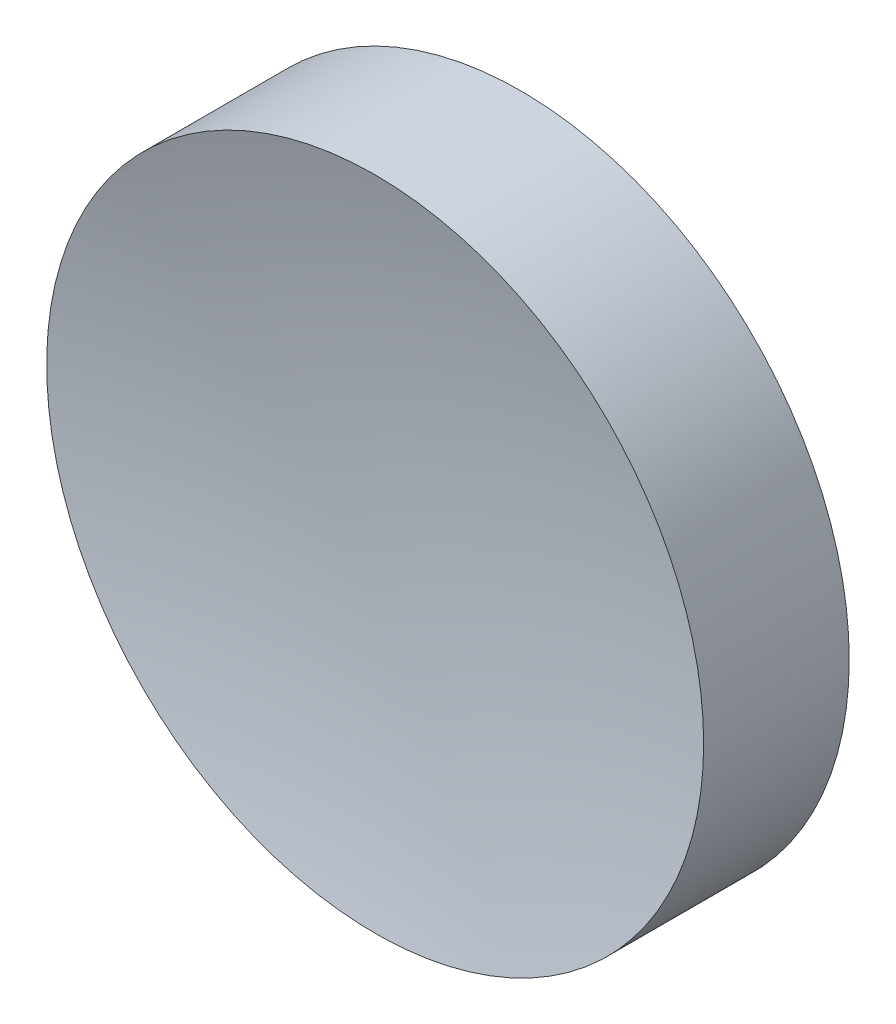
ISO-10303-21;
HEADER;
FILE_DESCRIPTION(('STEP AP214'),'2;1');
FILE_NAME('part.step','',(''),(''),'','','');
FILE_SCHEMA(('AUTOMOTIVE_DESIGN { 1 0 10303 214 1 1 1 1 }'));
ENDSEC;
DATA;
#1=APPLICATION_CONTEXT('core data for automotive mechanical design processes');
#2=APPLICATION_PROTOCOL_DEFINITION('international standard','automotive_design',2000,#1);
#3=PRODUCT_CONTEXT('',#1,'mechanical');
#4=PRODUCT('Part','Part','',(#3));
#5=PRODUCT_RELATED_PRODUCT_CATEGORY('part','',(#4));
#6=PRODUCT_DEFINITION_FORMATION('','',#4);
#7=PRODUCT_DEFINITION_CONTEXT('part definition',#1,'design');
#8=PRODUCT_DEFINITION('design','',#6,#7);
#9=PRODUCT_DEFINITION_SHAPE('','',#8);
#10=(LENGTH_UNIT() NAMED_UNIT(*) SI_UNIT(.MILLI.,.METRE.));
#11=(NAMED_UNIT(*) PLANE_ANGLE_UNIT() SI_UNIT($,.RADIAN.));
#12=(NAMED_UNIT(*) SI_UNIT($,.STERADIAN.) SOLID_ANGLE_UNIT());
#13=UNCERTAINTY_MEASURE_WITH_UNIT(LENGTH_MEASURE(1.E-05),#10,'distance_accuracy_value','');
#14=(GEOMETRIC_REPRESENTATION_CONTEXT(3) GLOBAL_UNCERTAINTY_ASSIGNED_CONTEXT((#13)) GLOBAL_UNIT_ASSIGNED_CONTEXT((#10,
#11,#12)) REPRESENTATION_CONTEXT('',''));
#15=CARTESIAN_POINT('',(0.,0.,0.));
#16=DIRECTION('',(0.,0.,1.));
#17=DIRECTION('',(1.,0.,0.));
#18=AXIS2_PLACEMENT_3D('',#15,#16,#17);
#19=CARTESIAN_POINT('',(0.,0.,52.7299919935936));
#20=DIRECTION('',(0.,0.,1.));
#21=DIRECTION('',(0.,1.,0.));
#22=AXIS2_PLACEMENT_3D('',#19,#20,#21);
#23=SPHERICAL_SURFACE('',#22,51.5);
#24=CARTESIAN_POINT('',(0.,0.,2.77000800640641));
#25=DIRECTION('',(0.,0.,1.));
#26=DIRECTION('',(1.,0.,0.));
#27=AXIS2_PLACEMENT_3D('',#24,#25,#26);
#28=CIRCLE('',#27,12.5);
#29=CARTESIAN_POINT('',(12.5,0.,2.77000800640641));
#30=VERTEX_POINT('',#29);
#31=EDGE_CURVE('E18',#30,#30,#28,.T.);
#32=ORIENTED_EDGE('',*,*,#31,.T.);
#33=EDGE_LOOP('',(#32));
#34=FACE_BOUND('',#33,.T.);
#35=ADVANCED_FACE('F12',(#34),#23,.F.);
#36=CARTESIAN_POINT('',(0.,0.,-2.77000800640641));
#37=DIRECTION('',(0.,0.,1.));
#38=DIRECTION('',(1.,0.,0.));
#39=AXIS2_PLACEMENT_3D('',#36,#37,#38);
#40=PLANE('',#39);
#41=CARTESIAN_POINT('',(0.,0.,-2.77000800640641));
#42=DIRECTION('',(0.,0.,1.));
#43=DIRECTION('',(1.,0.,0.));
#44=AXIS2_PLACEMENT_3D('',#41,#42,#43);
#45=CIRCLE('',#44,12.5);
#46=CARTESIAN_POINT('',(12.5,0.,-2.77000800640641));
#47=VERTEX_POINT('',#46);
#48=EDGE_CURVE('E8',#47,#47,#45,.T.);
#49=ORIENTED_EDGE('',*,*,#48,.F.);
#50=EDGE_LOOP('',(#49));
#51=FACE_BOUND('',#50,.T.);
#52=ADVANCED_FACE('F27',(#51),#40,.F.);
#53=CARTESIAN_POINT('',(0.,0.,8.24714526402292));
#54=DIRECTION('',(0.,0.,1.));
#55=DIRECTION('',(1.,0.,0.));
#56=AXIS2_PLACEMENT_3D('',#53,#54,#55);
#57=CYLINDRICAL_SURFACE('',#56,12.5);
#58=ORIENTED_EDGE('',*,*,#31,.F.);
#59=EDGE_LOOP('',(#58));
#60=FACE_BOUND('',#59,.T.);
#61=ORIENTED_EDGE('',*,*,#48,.T.);
#62=EDGE_LOOP('',(#61));
#63=FACE_BOUND('',#62,.T.);
#64=ADVANCED_FACE('F25',(#60,#63),#57,.T.);
#65=CLOSED_SHELL('',(#35,#52,#64));
#66=MANIFOLD_SOLID_BREP('B1',#65);
#67=ADVANCED_BREP_SHAPE_REPRESENTATION('',(#18,#66),#14);
#68=SHAPE_DEFINITION_REPRESENTATION(#9,#67);
ENDSEC;
END-ISO-10303-21;
